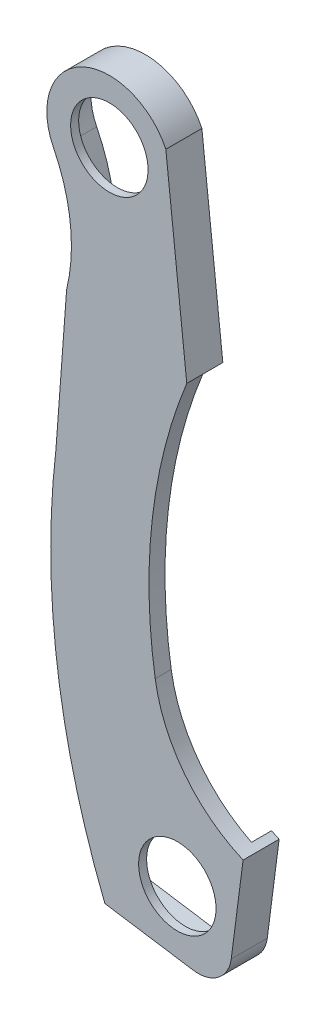
ISO-10303-21;
HEADER;
FILE_DESCRIPTION(('STEP AP214'),'2;1');
FILE_NAME('part.step','',(''),(''),'','','');
FILE_SCHEMA(('AUTOMOTIVE_DESIGN { 1 0 10303 214 1 1 1 1 }'));
ENDSEC;
DATA;
#1=APPLICATION_CONTEXT('core data for automotive mechanical design processes');
#2=APPLICATION_PROTOCOL_DEFINITION('international standard','automotive_design',2000,#1);
#3=PRODUCT_CONTEXT('',#1,'mechanical');
#4=PRODUCT('Part','Part','',(#3));
#5=PRODUCT_RELATED_PRODUCT_CATEGORY('part','',(#4));
#6=PRODUCT_DEFINITION_FORMATION('','',#4);
#7=PRODUCT_DEFINITION_CONTEXT('part definition',#1,'design');
#8=PRODUCT_DEFINITION('design','',#6,#7);
#9=PRODUCT_DEFINITION_SHAPE('','',#8);
#10=(LENGTH_UNIT() NAMED_UNIT(*) SI_UNIT(.MILLI.,.METRE.));
#11=(NAMED_UNIT(*) PLANE_ANGLE_UNIT() SI_UNIT($,.RADIAN.));
#12=(NAMED_UNIT(*) SI_UNIT($,.STERADIAN.) SOLID_ANGLE_UNIT());
#13=UNCERTAINTY_MEASURE_WITH_UNIT(LENGTH_MEASURE(1.E-05),#10,'distance_accuracy_value','');
#14=(GEOMETRIC_REPRESENTATION_CONTEXT(3) GLOBAL_UNCERTAINTY_ASSIGNED_CONTEXT((#13)) GLOBAL_UNIT_ASSIGNED_CONTEXT((#10,
#11,#12)) REPRESENTATION_CONTEXT('',''));
#15=CARTESIAN_POINT('',(0.,0.,0.));
#16=DIRECTION('',(0.,0.,1.));
#17=DIRECTION('',(1.,0.,0.));
#18=AXIS2_PLACEMENT_3D('',#15,#16,#17);
#19=CARTESIAN_POINT('',(57.3609756659918,78.037747086541,0.));
#20=DIRECTION('',(0.,0.,1.));
#21=DIRECTION('',(1.,0.,0.));
#22=AXIS2_PLACEMENT_3D('',#19,#20,#21);
#23=PLANE('',#22);
#24=DIRECTION('',(0.128345096378865,0.991729568095809,0.));
#25=VECTOR('',#24,1.);
#26=CARTESIAN_POINT('',(69.326238992548,25.8115460499817,0.));
#27=LINE('',#26,#25);
#28=CARTESIAN_POINT('',(68.1984366723897,17.0969559376612,0.));
#29=VERTEX_POINT('',#28);
#30=CARTESIAN_POINT('',(69.3570852276715,26.0498965931615,0.));
#31=VERTEX_POINT('',#30);
#32=EDGE_CURVE('E247',#29,#31,#27,.T.);
#33=ORIENTED_EDGE('',*,*,#32,.T.);
#34=CARTESIAN_POINT('',(75.6489756659918,38.667747086541,0.));
#35=DIRECTION('',(0.,0.,-1.));
#36=DIRECTION('',(1.,0.,0.));
#37=AXIS2_PLACEMENT_3D('',#34,#35,#36);
#38=CIRCLE('',#37,14.0995757511035);
#39=CARTESIAN_POINT('',(70.081936923437,25.713747086541,0.));
#40=VERTEX_POINT('',#39);
#41=EDGE_CURVE('E46',#40,#31,#38,.T.);
#42=ORIENTED_EDGE('',*,*,#41,.F.);
#43=DIRECTION('',(0.128345096378865,0.991729568095809,0.));
#44=VECTOR('',#43,1.);
#45=CARTESIAN_POINT('',(70.081936923437,25.713747086541,0.));
#46=LINE('',#45,#44);
#47=CARTESIAN_POINT('',(68.9541346032787,16.9991569742205,0.));
#48=VERTEX_POINT('',#47);
#49=EDGE_CURVE('E316',#48,#40,#46,.T.);
#50=ORIENTED_EDGE('',*,*,#49,.F.);
#51=CARTESIAN_POINT('',(65.8053932245745,17.4066526552234,0.));
#52=DIRECTION('',(0.,0.,1.));
#53=DIRECTION('',(1.,0.,0.));
#54=AXIS2_PLACEMENT_3D('',#51,#52,#53);
#55=CIRCLE('',#54,3.175);
#56=CARTESIAN_POINT('',(65.3242260184513,14.2683245780856,0.));
#57=VERTEX_POINT('',#56);
#58=EDGE_CURVE('E356',#48,#57,#55,.F.);
#59=ORIENTED_EDGE('',*,*,#58,.T.);
#60=DIRECTION('',(0.988449788074904,-0.151548726338026,0.));
#61=VECTOR('',#60,1.);
#62=CARTESIAN_POINT('',(56.9402848480354,15.553747086541,0.));
#63=LINE('',#62,#61);
#64=CARTESIAN_POINT('',(56.9402848480354,15.553747086541,0.));
#65=VERTEX_POINT('',#64);
#66=EDGE_CURVE('E312',#65,#57,#63,.T.);
#67=ORIENTED_EDGE('',*,*,#66,.F.);
#68=CARTESIAN_POINT('',(123.400975665992,42.223747086541,0.));
#69=DIRECTION('',(0.,0.,1.));
#70=DIRECTION('',(1.,0.,0.));
#71=AXIS2_PLACEMENT_3D('',#68,#69,#70);
#72=CIRCLE('',#71,71.6122358539377);
#73=CARTESIAN_POINT('',(52.2809756659918,50.605747086541,0.));
#74=VERTEX_POINT('',#73);
#75=EDGE_CURVE('E309',#74,#65,#72,.T.);
#76=ORIENTED_EDGE('',*,*,#75,.F.);
#77=DIRECTION('',(-0.0739753638047676,-0.997260069164484,0.));
#78=VECTOR('',#77,1.);
#79=CARTESIAN_POINT('',(53.2969756659918,64.3024182235043,0.));
#80=LINE('',#79,#78);
#81=CARTESIAN_POINT('',(53.2969756659918,64.3024182235043,0.));
#82=VERTEX_POINT('',#81);
#83=EDGE_CURVE('E306',#82,#74,#80,.T.);
#84=ORIENTED_EDGE('',*,*,#83,.F.);
#85=CARTESIAN_POINT('',(37.5489756659918,68.131747086541,0.));
#86=DIRECTION('',(0.,0.,-1.));
#87=DIRECTION('',(1.,0.,0.));
#88=AXIS2_PLACEMENT_3D('',#85,#86,#87);
#89=CIRCLE('',#88,16.2068893851129);
#90=CARTESIAN_POINT('',(52.0448582135648,75.3796883603275,0.));
#91=VERTEX_POINT('',#90);
#92=EDGE_CURVE('E302',#91,#82,#89,.T.);
#93=ORIENTED_EDGE('',*,*,#92,.F.);
#94=CARTESIAN_POINT('',(57.3609756659918,78.037747086541,0.));
#95=DIRECTION('',(0.,0.,1.));
#96=DIRECTION('',(1.,0.,0.));
#97=AXIS2_PLACEMENT_3D('',#94,#95,#96);
#98=CIRCLE('',#97,5.94359999999999);
#99=CARTESIAN_POINT('',(62.7345015996782,80.577747086541,0.));
#100=VERTEX_POINT('',#99);
#101=EDGE_CURVE('E298',#100,#91,#98,.T.);
#102=ORIENTED_EDGE('',*,*,#101,.F.);
#103=DIRECTION('',(-0.108308886592552,0.994117289400542,0.));
#104=VECTOR('',#103,1.);
#105=CARTESIAN_POINT('',(62.7345015996782,80.577747086541,0.));
#106=LINE('',#105,#104);
#107=CARTESIAN_POINT('',(64.7269756659918,62.289747086541,0.));
#108=VERTEX_POINT('',#107);
#109=EDGE_CURVE('E272',#108,#100,#106,.T.);
#110=ORIENTED_EDGE('',*,*,#109,.F.);
#111=DIRECTION('',(0.994117289400543,0.108308886592552,0.));
#112=VECTOR('',#111,1.);
#113=CARTESIAN_POINT('',(46.3979136865915,60.2927993255059,0.));
#114=LINE('',#113,#112);
#115=CARTESIAN_POINT('',(63.8672306434838,62.1960780324625,0.));
#116=VERTEX_POINT('',#115);
#117=EDGE_CURVE('E479',#116,#108,#114,.T.);
#118=ORIENTED_EDGE('',*,*,#117,.F.);
#119=CARTESIAN_POINT('',(109.430975665992,44.001747086541,0.));
#120=DIRECTION('',(0.,0.,1.));
#121=DIRECTION('',(1.,0.,0.));
#122=AXIS2_PLACEMENT_3D('',#119,#120,#121);
#123=CIRCLE('',#122,49.0620886127551);
#124=CARTESIAN_POINT('',(63.9486105484076,62.3985675280356,0.));
#125=VERTEX_POINT('',#124);
#126=EDGE_CURVE('E244',#116,#125,#123,.F.);
#127=ORIENTED_EDGE('',*,*,#126,.T.);
#128=DIRECTION('',(-0.108308886592552,0.994117289400542,0.));
#129=VECTOR('',#128,1.);
#130=CARTESIAN_POINT('',(61.976984225155,80.4952157149575,0.));
#131=LINE('',#130,#129);
#132=CARTESIAN_POINT('',(61.9913457586041,80.3633978267562,0.));
#133=VERTEX_POINT('',#132);
#134=EDGE_CURVE('E239',#125,#133,#131,.T.);
#135=ORIENTED_EDGE('',*,*,#134,.T.);
#136=CARTESIAN_POINT('',(57.3609756659918,78.037747086541,0.));
#137=DIRECTION('',(0.,0.,1.));
#138=DIRECTION('',(1.,0.,0.));
#139=AXIS2_PLACEMENT_3D('',#136,#137,#138);
#140=CIRCLE('',#139,5.1816);
#141=CARTESIAN_POINT('',(52.7264117331067,75.7204651200985,0.));
#142=VERTEX_POINT('',#141);
#143=EDGE_CURVE('E233',#133,#142,#140,.T.);
#144=ORIENTED_EDGE('',*,*,#143,.T.);
#145=CARTESIAN_POINT('',(37.5489756659918,68.131747086541,0.));
#146=DIRECTION('',(0.,0.,1.));
#147=DIRECTION('',(1.,0.,0.));
#148=AXIS2_PLACEMENT_3D('',#145,#146,#147);
#149=CIRCLE('',#148,16.9688893851129);
#150=CARTESIAN_POINT('',(54.052294981693,64.1841328034323,0.));
#151=VERTEX_POINT('',#150);
#152=EDGE_CURVE('E237',#142,#151,#149,.F.);
#153=ORIENTED_EDGE('',*,*,#152,.T.);
#154=DIRECTION('',(-0.0739753638047676,-0.997260069164485,0.));
#155=VECTOR('',#154,1.);
#156=CARTESIAN_POINT('',(54.0568878386952,64.2460489962851,0.));
#157=LINE('',#156,#155);
#158=CARTESIAN_POINT('',(53.039664752985,50.5328894707937,0.));
#159=VERTEX_POINT('',#158);
#160=EDGE_CURVE('E260',#151,#159,#157,.T.);
#161=ORIENTED_EDGE('',*,*,#160,.T.);
#162=CARTESIAN_POINT('',(123.400975665992,42.223747086541,0.));
#163=DIRECTION('',(0.,0.,1.));
#164=DIRECTION('',(1.,0.,0.));
#165=AXIS2_PLACEMENT_3D('',#162,#163,#164);
#166=CIRCLE('',#165,70.8502358539377);
#167=CARTESIAN_POINT('',(57.4870669911204,16.2408187727556,0.));
#168=VERTEX_POINT('',#167);
#169=EDGE_CURVE('E256',#159,#168,#166,.T.);
#170=ORIENTED_EDGE('',*,*,#169,.T.);
#171=DIRECTION('',(0.988449788074904,-0.151548726338026,0.));
#172=VECTOR('',#171,1.);
#173=CARTESIAN_POINT('',(57.055764977505,16.3069458250541,0.));
#174=LINE('',#173,#172);
#175=CARTESIAN_POINT('',(65.4397061479209,15.0215233165987,0.));
#176=VERTEX_POINT('',#175);
#177=EDGE_CURVE('E252',#168,#176,#174,.T.);
#178=ORIENTED_EDGE('',*,*,#177,.T.);
#179=CARTESIAN_POINT('',(65.8053932245745,17.4066526552234,0.));
#180=DIRECTION('',(0.,0.,1.));
#181=DIRECTION('',(1.,0.,0.));
#182=AXIS2_PLACEMENT_3D('',#179,#180,#181);
#183=CIRCLE('',#182,2.413);
#184=EDGE_CURVE('E248',#29,#176,#183,.F.);
#185=ORIENTED_EDGE('',*,*,#184,.F.);
#186=EDGE_LOOP('',(#33,#42,#50,#59,#67,#76,#84,#93,#102,#110,#118,#127,#135,#144,#153,#161,#170,
#178,#185));
#187=FACE_BOUND('',#186,.T.);
#188=ADVANCED_FACE('F42',(#187),#23,.F.);
#189=CARTESIAN_POINT('',(75.6489756659918,38.667747086541,3.429));
#190=DIRECTION('',(0.,0.,-1.));
#191=DIRECTION('',(-1.,0.,0.));
#192=AXIS2_PLACEMENT_3D('',#189,#190,#191);
#193=CYLINDRICAL_SURFACE('',#192,14.0995757511035);
#194=DIRECTION('',(0.,0.,-1.));
#195=VECTOR('',#194,1.);
#196=CARTESIAN_POINT('',(69.3570852276715,26.0498965931615,1.778));
#197=LINE('',#196,#195);
#198=CARTESIAN_POINT('',(69.3570852276715,26.0498965931615,1.905));
#199=VERTEX_POINT('',#198);
#200=EDGE_CURVE('E209',#199,#31,#197,.T.);
#201=ORIENTED_EDGE('',*,*,#200,.F.);
#202=CARTESIAN_POINT('',(75.6489756659918,38.667747086541,1.905));
#203=DIRECTION('',(0.,0.,1.));
#204=DIRECTION('',(0.,-1.,0.));
#205=AXIS2_PLACEMENT_3D('',#202,#203,#204);
#206=CIRCLE('',#205,14.0995757511035);
#207=CARTESIAN_POINT('',(61.7219369122,36.4687409675213,1.905));
#208=VERTEX_POINT('',#207);
#209=EDGE_CURVE('E199',#208,#199,#206,.T.);
#210=ORIENTED_EDGE('',*,*,#209,.F.);
#211=DIRECTION('',(0.,0.,-1.));
#212=VECTOR('',#211,1.);
#213=CARTESIAN_POINT('',(61.7219369122,36.4687409675213,3.429));
#214=LINE('',#213,#212);
#215=CARTESIAN_POINT('',(61.7219369122,36.4687409675213,3.429));
#216=VERTEX_POINT('',#215);
#217=EDGE_CURVE('E328',#216,#208,#214,.T.);
#218=ORIENTED_EDGE('',*,*,#217,.F.);
#219=CARTESIAN_POINT('',(75.6489756659918,38.667747086541,3.429));
#220=DIRECTION('',(0.,0.,-1.));
#221=DIRECTION('',(1.,0.,0.));
#222=AXIS2_PLACEMENT_3D('',#219,#220,#221);
#223=CIRCLE('',#222,14.0995757511035);
#224=CARTESIAN_POINT('',(70.081936923437,25.713747086541,3.429));
#225=VERTEX_POINT('',#224);
#226=EDGE_CURVE('E288',#225,#216,#223,.T.);
#227=ORIENTED_EDGE('',*,*,#226,.F.);
#228=DIRECTION('',(0.,0.,-1.));
#229=VECTOR('',#228,1.);
#230=CARTESIAN_POINT('',(70.081936923437,25.713747086541,3.429));
#231=LINE('',#230,#229);
#232=EDGE_CURVE('E332',#225,#40,#231,.T.);
#233=ORIENTED_EDGE('',*,*,#232,.T.);
#234=ORIENTED_EDGE('',*,*,#41,.T.);
#235=EDGE_LOOP('',(#201,#210,#218,#227,#233,#234));
#236=FACE_BOUND('',#235,.T.);
#237=ADVANCED_FACE('F373',(#236),#193,.F.);
#238=CARTESIAN_POINT('',(75.6489756659918,38.667747086541,3.429));
#239=DIRECTION('',(0.,0.,-1.));
#240=DIRECTION('',(-1.,0.,0.));
#241=AXIS2_PLACEMENT_3D('',#238,#239,#240);
#242=CYLINDRICAL_SURFACE('',#241,14.8615757511035);
#243=CARTESIAN_POINT('',(75.6489756659918,38.667747086541,1.905));
#244=DIRECTION('',(0.,0.,1.));
#245=DIRECTION('',(0.,-1.,0.));
#246=AXIS2_PLACEMENT_3D('',#243,#244,#245);
#247=CIRCLE('',#246,14.8615757511035);
#248=CARTESIAN_POINT('',(60.9692615326193,36.3498974865348,1.90499999999999));
#249=VERTEX_POINT('',#248);
#250=CARTESIAN_POINT('',(69.2538877410961,25.2524839792203,1.905));
#251=VERTEX_POINT('',#250);
#252=EDGE_CURVE('E61',#249,#251,#247,.T.);
#253=ORIENTED_EDGE('',*,*,#252,.T.);
#254=DIRECTION('',(0.,0.,-1.));
#255=VECTOR('',#254,1.);
#256=CARTESIAN_POINT('',(69.2538877410961,25.2524839792203,2.667));
#257=LINE('',#256,#255);
#258=CARTESIAN_POINT('',(69.2538877410961,25.2524839792203,2.667));
#259=VERTEX_POINT('',#258);
#260=EDGE_CURVE('E193',#259,#251,#257,.T.);
#261=ORIENTED_EDGE('',*,*,#260,.F.);
#262=CARTESIAN_POINT('',(75.6489756659918,38.667747086541,2.667));
#263=DIRECTION('',(0.,0.,1.));
#264=DIRECTION('',(1.,0.,0.));
#265=AXIS2_PLACEMENT_3D('',#262,#263,#264);
#266=CIRCLE('',#265,14.8615757511035);
#267=CARTESIAN_POINT('',(60.9692615326193,36.3498974865348,2.667));
#268=VERTEX_POINT('',#267);
#269=EDGE_CURVE('E537',#259,#268,#266,.F.);
#270=ORIENTED_EDGE('',*,*,#269,.T.);
#271=DIRECTION('',(0.,0.,-1.));
#272=VECTOR('',#271,1.);
#273=CARTESIAN_POINT('',(60.9692615326193,36.3498974865348,3.429));
#274=LINE('',#273,#272);
#275=EDGE_CURVE('E196',#268,#249,#274,.T.);
#276=ORIENTED_EDGE('',*,*,#275,.T.);
#277=EDGE_LOOP('',(#253,#261,#270,#276));
#278=FACE_BOUND('',#277,.T.);
#279=ADVANCED_FACE('F191',(#278),#242,.T.);
#280=CARTESIAN_POINT('',(57.3609756659918,78.037747086541,3.429));
#281=DIRECTION('',(0.,0.,-1.));
#282=DIRECTION('',(-1.,0.,0.));
#283=AXIS2_PLACEMENT_3D('',#280,#281,#282);
#284=CYLINDRICAL_SURFACE('',#283,5.94359999999999);
#285=ORIENTED_EDGE('',*,*,#101,.T.);
#286=DIRECTION('',(0.,0.,-1.));
#287=VECTOR('',#286,1.);
#288=CARTESIAN_POINT('',(52.0448582135648,75.3796883603275,3.429));
#289=LINE('',#288,#287);
#290=CARTESIAN_POINT('',(52.0448582135648,75.3796883603275,3.429));
#291=VERTEX_POINT('',#290);
#292=EDGE_CURVE('E348',#291,#91,#289,.T.);
#293=ORIENTED_EDGE('',*,*,#292,.F.);
#294=CARTESIAN_POINT('',(57.3609756659918,78.037747086541,3.429));
#295=DIRECTION('',(0.,0.,1.));
#296=DIRECTION('',(1.,0.,0.));
#297=AXIS2_PLACEMENT_3D('',#294,#295,#296);
#298=CIRCLE('',#297,5.94359999999999);
#299=CARTESIAN_POINT('',(62.7345015996782,80.577747086541,3.429));
#300=VERTEX_POINT('',#299);
#301=EDGE_CURVE('E267',#300,#291,#298,.T.);
#302=ORIENTED_EDGE('',*,*,#301,.F.);
#303=DIRECTION('',(0.,0.,-1.));
#304=VECTOR('',#303,1.);
#305=CARTESIAN_POINT('',(62.7345015996782,80.577747086541,3.429));
#306=LINE('',#305,#304);
#307=EDGE_CURVE('E297',#300,#100,#306,.T.);
#308=ORIENTED_EDGE('',*,*,#307,.T.);
#309=EDGE_LOOP('',(#285,#293,#302,#308));
#310=FACE_BOUND('',#309,.T.);
#311=ADVANCED_FACE('F628',(#310),#284,.T.);
#312=CARTESIAN_POINT('',(37.5489756659918,68.131747086541,3.429));
#313=DIRECTION('',(0.,0.,-1.));
#314=DIRECTION('',(-1.,0.,0.));
#315=AXIS2_PLACEMENT_3D('',#312,#313,#314);
#316=CYLINDRICAL_SURFACE('',#315,16.2068893851129);
#317=ORIENTED_EDGE('',*,*,#92,.T.);
#318=DIRECTION('',(0.,0.,-1.));
#319=VECTOR('',#318,1.);
#320=CARTESIAN_POINT('',(53.2969756659918,64.3024182235043,3.429));
#321=LINE('',#320,#319);
#322=CARTESIAN_POINT('',(53.2969756659918,64.3024182235043,3.429));
#323=VERTEX_POINT('',#322);
#324=EDGE_CURVE('E344',#323,#82,#321,.T.);
#325=ORIENTED_EDGE('',*,*,#324,.F.);
#326=CARTESIAN_POINT('',(37.5489756659918,68.131747086541,3.429));
#327=DIRECTION('',(0.,0.,-1.));
#328=DIRECTION('',(1.,0.,0.));
#329=AXIS2_PLACEMENT_3D('',#326,#327,#328);
#330=CIRCLE('',#329,16.2068893851129);
#331=EDGE_CURVE('E271',#291,#323,#330,.T.);
#332=ORIENTED_EDGE('',*,*,#331,.F.);
#333=ORIENTED_EDGE('',*,*,#292,.T.);
#334=EDGE_LOOP('',(#317,#325,#332,#333));
#335=FACE_BOUND('',#334,.T.);
#336=ADVANCED_FACE('F625',(#335),#316,.F.);
#337=CARTESIAN_POINT('',(53.2969756659918,64.3024182235043,3.429));
#338=DIRECTION('',(0.997260069164485,-0.0739753638047676,0.));
#339=DIRECTION('',(0.0739753638047676,0.997260069164485,0.));
#340=AXIS2_PLACEMENT_3D('',#337,#338,#339);
#341=PLANE('',#340);
#342=ORIENTED_EDGE('',*,*,#83,.T.);
#343=DIRECTION('',(0.,0.,-1.));
#344=VECTOR('',#343,1.);
#345=CARTESIAN_POINT('',(52.2809756659918,50.605747086541,3.429));
#346=LINE('',#345,#344);
#347=CARTESIAN_POINT('',(52.2809756659918,50.605747086541,3.429));
#348=VERTEX_POINT('',#347);
#349=EDGE_CURVE('E340',#348,#74,#346,.T.);
#350=ORIENTED_EDGE('',*,*,#349,.F.);
#351=DIRECTION('',(-0.0739753638047676,-0.997260069164484,0.));
#352=VECTOR('',#351,1.);
#353=CARTESIAN_POINT('',(53.2969756659918,64.3024182235043,3.429));
#354=LINE('',#353,#352);
#355=EDGE_CURVE('E275',#323,#348,#354,.T.);
#356=ORIENTED_EDGE('',*,*,#355,.F.);
#357=ORIENTED_EDGE('',*,*,#324,.T.);
#358=EDGE_LOOP('',(#342,#350,#356,#357));
#359=FACE_BOUND('',#358,.T.);
#360=ADVANCED_FACE('F621',(#359),#341,.F.);
#361=CARTESIAN_POINT('',(123.400975665992,42.223747086541,3.429));
#362=DIRECTION('',(0.,0.,-1.));
#363=DIRECTION('',(-1.,0.,0.));
#364=AXIS2_PLACEMENT_3D('',#361,#362,#363);
#365=CYLINDRICAL_SURFACE('',#364,71.6122358539377);
#366=ORIENTED_EDGE('',*,*,#75,.T.);
#367=DIRECTION('',(0.,0.,-1.));
#368=VECTOR('',#367,1.);
#369=CARTESIAN_POINT('',(56.9402848480354,15.553747086541,3.429));
#370=LINE('',#369,#368);
#371=CARTESIAN_POINT('',(56.9402848480354,15.553747086541,3.429));
#372=VERTEX_POINT('',#371);
#373=EDGE_CURVE('E336',#372,#65,#370,.T.);
#374=ORIENTED_EDGE('',*,*,#373,.F.);
#375=CARTESIAN_POINT('',(123.400975665992,42.223747086541,3.429));
#376=DIRECTION('',(0.,0.,1.));
#377=DIRECTION('',(1.,0.,0.));
#378=AXIS2_PLACEMENT_3D('',#375,#376,#377);
#379=CIRCLE('',#378,71.6122358539377);
#380=EDGE_CURVE('E278',#348,#372,#379,.T.);
#381=ORIENTED_EDGE('',*,*,#380,.F.);
#382=ORIENTED_EDGE('',*,*,#349,.T.);
#383=EDGE_LOOP('',(#366,#374,#381,#382));
#384=FACE_BOUND('',#383,.T.);
#385=ADVANCED_FACE('F617',(#384),#365,.T.);
#386=CARTESIAN_POINT('',(56.9402848480354,15.553747086541,3.429));
#387=DIRECTION('',(0.151548726338026,0.988449788074904,0.));
#388=DIRECTION('',(-0.988449788074904,0.151548726338026,0.));
#389=AXIS2_PLACEMENT_3D('',#386,#387,#388);
#390=PLANE('',#389);
#391=ORIENTED_EDGE('',*,*,#66,.T.);
#392=DIRECTION('',(0.,0.,-1.));
#393=VECTOR('',#392,1.);
#394=CARTESIAN_POINT('',(65.3242260184513,14.2683245780856,3.429));
#395=LINE('',#394,#393);
#396=CARTESIAN_POINT('',(65.3242260184513,14.2683245780856,3.429));
#397=VERTEX_POINT('',#396);
#398=EDGE_CURVE('E53',#57,#397,#395,.F.);
#399=ORIENTED_EDGE('',*,*,#398,.T.);
#400=DIRECTION('',(0.988449788074904,-0.151548726338026,0.));
#401=VECTOR('',#400,1.);
#402=CARTESIAN_POINT('',(56.9402848480354,15.553747086541,3.429));
#403=LINE('',#402,#401);
#404=EDGE_CURVE('E281',#372,#397,#403,.T.);
#405=ORIENTED_EDGE('',*,*,#404,.F.);
#406=ORIENTED_EDGE('',*,*,#373,.T.);
#407=EDGE_LOOP('',(#391,#399,#405,#406));
#408=FACE_BOUND('',#407,.T.);
#409=ADVANCED_FACE('F613',(#408),#390,.F.);
#410=CARTESIAN_POINT('',(70.081936923437,25.713747086541,3.429));
#411=DIRECTION('',(-0.991729568095809,0.128345096378865,0.));
#412=DIRECTION('',(-0.128345096378865,-0.991729568095809,0.));
#413=AXIS2_PLACEMENT_3D('',#410,#411,#412);
#414=PLANE('',#413);
#415=DIRECTION('',(0.128345096378865,0.991729568095809,0.));
#416=VECTOR('',#415,1.);
#417=CARTESIAN_POINT('',(70.081936923437,25.713747086541,3.429));
#418=LINE('',#417,#416);
#419=CARTESIAN_POINT('',(68.9541346032787,16.9991569742205,3.429));
#420=VERTEX_POINT('',#419);
#421=EDGE_CURVE('E285',#420,#225,#418,.T.);
#422=ORIENTED_EDGE('',*,*,#421,.F.);
#423=DIRECTION('',(0.,0.,-1.));
#424=VECTOR('',#423,1.);
#425=CARTESIAN_POINT('',(68.9541346032787,16.9991569742205,3.429));
#426=LINE('',#425,#424);
#427=EDGE_CURVE('E352',#420,#48,#426,.T.);
#428=ORIENTED_EDGE('',*,*,#427,.T.);
#429=ORIENTED_EDGE('',*,*,#49,.T.);
#430=ORIENTED_EDGE('',*,*,#232,.F.);
#431=EDGE_LOOP('',(#422,#428,#429,#430));
#432=FACE_BOUND('',#431,.T.);
#433=ADVANCED_FACE('F608',(#432),#414,.F.);
#434=CARTESIAN_POINT('',(109.430975665992,44.001747086541,3.429));
#435=DIRECTION('',(0.,0.,-1.));
#436=DIRECTION('',(-1.,0.,0.));
#437=AXIS2_PLACEMENT_3D('',#434,#435,#436);
#438=CYLINDRICAL_SURFACE('',#437,48.3000886127551);
#439=ORIENTED_EDGE('',*,*,#217,.T.);
#440=CARTESIAN_POINT('',(109.430975665992,44.001747086541,1.905));
#441=DIRECTION('',(0.,0.,1.));
#442=DIRECTION('',(0.,-1.,0.));
#443=AXIS2_PLACEMENT_3D('',#440,#441,#442);
#444=CIRCLE('',#443,48.3000886127551);
#445=CARTESIAN_POINT('',(64.7269756659918,62.289747086541,1.905));
#446=VERTEX_POINT('',#445);
#447=EDGE_CURVE('E371',#446,#208,#444,.T.);
#448=ORIENTED_EDGE('',*,*,#447,.F.);
#449=DIRECTION('',(0.,0.,-1.));
#450=VECTOR('',#449,1.);
#451=CARTESIAN_POINT('',(64.7269756659918,62.289747086541,3.429));
#452=LINE('',#451,#450);
#453=CARTESIAN_POINT('',(64.7269756659918,62.289747086541,3.429));
#454=VERTEX_POINT('',#453);
#455=EDGE_CURVE('E324',#454,#446,#452,.T.);
#456=ORIENTED_EDGE('',*,*,#455,.F.);
#457=CARTESIAN_POINT('',(109.430975665992,44.001747086541,3.429));
#458=DIRECTION('',(0.,0.,-1.));
#459=DIRECTION('',(1.,0.,0.));
#460=AXIS2_PLACEMENT_3D('',#457,#458,#459);
#461=CIRCLE('',#460,48.3000886127551);
#462=EDGE_CURVE('E291',#216,#454,#461,.T.);
#463=ORIENTED_EDGE('',*,*,#462,.F.);
#464=EDGE_LOOP('',(#439,#448,#456,#463));
#465=FACE_BOUND('',#464,.T.);
#466=ADVANCED_FACE('F605',(#465),#438,.F.);
#467=CARTESIAN_POINT('',(62.7345015996782,80.577747086541,3.429));
#468=DIRECTION('',(-0.994117289400542,-0.108308886592552,0.));
#469=DIRECTION('',(0.108308886592552,-0.994117289400542,0.));
#470=AXIS2_PLACEMENT_3D('',#467,#468,#469);
#471=PLANE('',#470);
#472=ORIENTED_EDGE('',*,*,#109,.T.);
#473=ORIENTED_EDGE('',*,*,#307,.F.);
#474=DIRECTION('',(-0.108308886592552,0.994117289400542,0.));
#475=VECTOR('',#474,1.);
#476=CARTESIAN_POINT('',(62.7345015996782,80.577747086541,3.429));
#477=LINE('',#476,#475);
#478=EDGE_CURVE('E294',#454,#300,#477,.T.);
#479=ORIENTED_EDGE('',*,*,#478,.F.);
#480=ORIENTED_EDGE('',*,*,#455,.T.);
#481=DIRECTION('',(0.,0.,1.));
#482=VECTOR('',#481,1.);
#483=CARTESIAN_POINT('',(64.7269756659918,62.289747086541,1.905));
#484=LINE('',#483,#482);
#485=EDGE_CURVE('E484',#108,#446,#484,.T.);
#486=ORIENTED_EDGE('',*,*,#485,.F.);
#487=EDGE_LOOP('',(#472,#473,#479,#480,#486));
#488=FACE_BOUND('',#487,.T.);
#489=ADVANCED_FACE('F602',(#488),#471,.F.);
#490=CARTESIAN_POINT('',(57.3609756659918,78.037747086541,3.429));
#491=DIRECTION('',(0.,0.,1.));
#492=DIRECTION('',(1.,0.,0.));
#493=AXIS2_PLACEMENT_3D('',#490,#491,#492);
#494=PLANE('',#493);
#495=CARTESIAN_POINT('',(57.3609756659918,78.037747086541,3.429));
#496=DIRECTION('',(0.,0.,1.));
#497=DIRECTION('',(1.,0.,0.));
#498=AXIS2_PLACEMENT_3D('',#495,#496,#497);
#499=CIRCLE('',#498,3.683);
#500=CARTESIAN_POINT('',(53.6779756659918,78.037747086541,3.429));
#501=VERTEX_POINT('',#500);
#502=EDGE_CURVE('E461',#501,#501,#499,.F.);
#503=ORIENTED_EDGE('',*,*,#502,.T.);
#504=EDGE_LOOP('',(#503));
#505=FACE_BOUND('',#504,.T.);
#506=CARTESIAN_POINT('',(63.8264134086376,20.4210818214808,3.429));
#507=DIRECTION('',(0.,0.,1.));
#508=DIRECTION('',(1.,0.,0.));
#509=AXIS2_PLACEMENT_3D('',#506,#507,#508);
#510=CIRCLE('',#509,3.68299999999999);
#511=CARTESIAN_POINT('',(60.1434134086376,20.4210818214808,3.429));
#512=VERTEX_POINT('',#511);
#513=EDGE_CURVE('E467',#512,#512,#510,.F.);
#514=ORIENTED_EDGE('',*,*,#513,.T.);
#515=EDGE_LOOP('',(#514));
#516=FACE_BOUND('',#515,.T.);
#517=ORIENTED_EDGE('',*,*,#404,.T.);
#518=CARTESIAN_POINT('',(65.8053932245745,17.4066526552234,3.429));
#519=DIRECTION('',(0.,0.,1.));
#520=DIRECTION('',(1.,0.,0.));
#521=AXIS2_PLACEMENT_3D('',#518,#519,#520);
#522=CIRCLE('',#521,3.175);
#523=EDGE_CURVE('E11',#397,#420,#522,.T.);
#524=ORIENTED_EDGE('',*,*,#523,.T.);
#525=ORIENTED_EDGE('',*,*,#421,.T.);
#526=ORIENTED_EDGE('',*,*,#226,.T.);
#527=ORIENTED_EDGE('',*,*,#462,.T.);
#528=ORIENTED_EDGE('',*,*,#478,.T.);
#529=ORIENTED_EDGE('',*,*,#301,.T.);
#530=ORIENTED_EDGE('',*,*,#331,.T.);
#531=ORIENTED_EDGE('',*,*,#355,.T.);
#532=ORIENTED_EDGE('',*,*,#380,.T.);
#533=EDGE_LOOP('',(#517,#524,#525,#526,#527,#528,#529,#530,#531,#532));
#534=FACE_BOUND('',#533,.T.);
#535=ADVANCED_FACE('F600',(#505,#516,#534),#494,.T.);
#536=CARTESIAN_POINT('',(65.8053932245745,17.4066526552234,3.429));
#537=DIRECTION('',(0.,0.,-1.));
#538=DIRECTION('',(-1.,0.,0.));
#539=AXIS2_PLACEMENT_3D('',#536,#537,#538);
#540=CYLINDRICAL_SURFACE('',#539,3.175);
#541=ORIENTED_EDGE('',*,*,#523,.F.);
#542=ORIENTED_EDGE('',*,*,#398,.F.);
#543=ORIENTED_EDGE('',*,*,#58,.F.);
#544=ORIENTED_EDGE('',*,*,#427,.F.);
#545=EDGE_LOOP('',(#541,#542,#543,#544));
#546=FACE_BOUND('',#545,.T.);
#547=ADVANCED_FACE('F44',(#546),#540,.T.);
#548=CARTESIAN_POINT('',(57.3609756659918,78.037747086541,3.429));
#549=DIRECTION('',(0.,0.,-1.));
#550=DIRECTION('',(-1.,0.,0.));
#551=AXIS2_PLACEMENT_3D('',#548,#549,#550);
#552=CYLINDRICAL_SURFACE('',#551,5.1816);
#553=ORIENTED_EDGE('',*,*,#143,.F.);
#554=DIRECTION('',(0.,0.,-1.));
#555=VECTOR('',#554,1.);
#556=CARTESIAN_POINT('',(61.9913457586041,80.3633978267562,2.667));
#557=LINE('',#556,#555);
#558=CARTESIAN_POINT('',(61.9913457586041,80.3633978267562,2.667));
#559=VERTEX_POINT('',#558);
#560=EDGE_CURVE('E232',#559,#133,#557,.T.);
#561=ORIENTED_EDGE('',*,*,#560,.F.);
#562=CARTESIAN_POINT('',(57.3609756659918,78.037747086541,2.667));
#563=DIRECTION('',(0.,0.,1.));
#564=DIRECTION('',(1.,0.,0.));
#565=AXIS2_PLACEMENT_3D('',#562,#563,#564);
#566=CIRCLE('',#565,5.1816);
#567=CARTESIAN_POINT('',(52.7264117331067,75.7204651200985,2.667));
#568=VERTEX_POINT('',#567);
#569=EDGE_CURVE('E243',#559,#568,#566,.T.);
#570=ORIENTED_EDGE('',*,*,#569,.T.);
#571=DIRECTION('',(0.,0.,-1.));
#572=VECTOR('',#571,1.);
#573=CARTESIAN_POINT('',(52.7264117331067,75.7204651200985,3.429));
#574=LINE('',#573,#572);
#575=EDGE_CURVE('E424',#568,#142,#574,.T.);
#576=ORIENTED_EDGE('',*,*,#575,.T.);
#577=EDGE_LOOP('',(#553,#561,#570,#576));
#578=FACE_BOUND('',#577,.T.);
#579=ADVANCED_FACE('F555',(#578),#552,.F.);
#580=CARTESIAN_POINT('',(37.5489756659918,68.131747086541,3.429));
#581=DIRECTION('',(0.,0.,-1.));
#582=DIRECTION('',(-1.,0.,0.));
#583=AXIS2_PLACEMENT_3D('',#580,#581,#582);
#584=CYLINDRICAL_SURFACE('',#583,16.9688893851129);
#585=ORIENTED_EDGE('',*,*,#152,.F.);
#586=ORIENTED_EDGE('',*,*,#575,.F.);
#587=CARTESIAN_POINT('',(37.5489756659918,68.131747086541,2.667));
#588=DIRECTION('',(0.,0.,1.));
#589=DIRECTION('',(1.,0.,0.));
#590=AXIS2_PLACEMENT_3D('',#587,#588,#589);
#591=CIRCLE('',#590,16.9688893851129);
#592=CARTESIAN_POINT('',(54.052294981693,64.1841328034323,2.667));
#593=VERTEX_POINT('',#592);
#594=EDGE_CURVE('E519',#568,#593,#591,.F.);
#595=ORIENTED_EDGE('',*,*,#594,.T.);
#596=DIRECTION('',(0.,0.,-1.));
#597=VECTOR('',#596,1.);
#598=CARTESIAN_POINT('',(54.052294981693,64.1841328034323,2.667));
#599=LINE('',#598,#597);
#600=EDGE_CURVE('E429',#593,#151,#599,.T.);
#601=ORIENTED_EDGE('',*,*,#600,.T.);
#602=EDGE_LOOP('',(#585,#586,#595,#601));
#603=FACE_BOUND('',#602,.T.);
#604=ADVANCED_FACE('F563',(#603),#584,.T.);
#605=CARTESIAN_POINT('',(54.0568878386952,64.2460489962851,3.429));
#606=DIRECTION('',(0.997260069164485,-0.0739753638047676,0.));
#607=DIRECTION('',(0.0739753638047676,0.997260069164485,0.));
#608=AXIS2_PLACEMENT_3D('',#605,#606,#607);
#609=PLANE('',#608);
#610=ORIENTED_EDGE('',*,*,#160,.F.);
#611=ORIENTED_EDGE('',*,*,#600,.F.);
#612=DIRECTION('',(-0.0739753638047676,-0.997260069164485,0.));
#613=VECTOR('',#612,1.);
#614=CARTESIAN_POINT('',(54.0568878386952,64.2460489962851,2.667));
#615=LINE('',#614,#613);
#616=CARTESIAN_POINT('',(53.039664752985,50.5328894707937,2.667));
#617=VERTEX_POINT('',#616);
#618=EDGE_CURVE('E524',#593,#617,#615,.T.);
#619=ORIENTED_EDGE('',*,*,#618,.T.);
#620=DIRECTION('',(0.,0.,-1.));
#621=VECTOR('',#620,1.);
#622=CARTESIAN_POINT('',(53.039664752985,50.5328894707937,2.667));
#623=LINE('',#622,#621);
#624=EDGE_CURVE('E221',#617,#159,#623,.T.);
#625=ORIENTED_EDGE('',*,*,#624,.T.);
#626=EDGE_LOOP('',(#610,#611,#619,#625));
#627=FACE_BOUND('',#626,.T.);
#628=ADVANCED_FACE('F566',(#627),#609,.T.);
#629=CARTESIAN_POINT('',(123.400975665992,42.223747086541,3.429));
#630=DIRECTION('',(0.,0.,-1.));
#631=DIRECTION('',(-1.,0.,0.));
#632=AXIS2_PLACEMENT_3D('',#629,#630,#631);
#633=CYLINDRICAL_SURFACE('',#632,70.8502358539377);
#634=ORIENTED_EDGE('',*,*,#169,.F.);
#635=ORIENTED_EDGE('',*,*,#624,.F.);
#636=CARTESIAN_POINT('',(123.400975665992,42.223747086541,2.667));
#637=DIRECTION('',(0.,0.,1.));
#638=DIRECTION('',(1.,0.,0.));
#639=AXIS2_PLACEMENT_3D('',#636,#637,#638);
#640=CIRCLE('',#639,70.8502358539377);
#641=CARTESIAN_POINT('',(57.4870669911204,16.2408187727556,2.667));
#642=VERTEX_POINT('',#641);
#643=EDGE_CURVE('E527',#617,#642,#640,.T.);
#644=ORIENTED_EDGE('',*,*,#643,.T.);
#645=DIRECTION('',(0.,0.,-1.));
#646=VECTOR('',#645,1.);
#647=CARTESIAN_POINT('',(57.4870669911204,16.2408187727556,2.667));
#648=LINE('',#647,#646);
#649=EDGE_CURVE('E216',#642,#168,#648,.T.);
#650=ORIENTED_EDGE('',*,*,#649,.T.);
#651=EDGE_LOOP('',(#634,#635,#644,#650));
#652=FACE_BOUND('',#651,.T.);
#653=ADVANCED_FACE('F583',(#652),#633,.F.);
#654=CARTESIAN_POINT('',(57.055764977505,16.3069458250541,3.429));
#655=DIRECTION('',(0.151548726338026,0.988449788074904,0.));
#656=DIRECTION('',(-0.988449788074904,0.151548726338026,0.));
#657=AXIS2_PLACEMENT_3D('',#654,#655,#656);
#658=PLANE('',#657);
#659=ORIENTED_EDGE('',*,*,#177,.F.);
#660=ORIENTED_EDGE('',*,*,#649,.F.);
#661=DIRECTION('',(0.988449788074904,-0.151548726338026,0.));
#662=VECTOR('',#661,1.);
#663=CARTESIAN_POINT('',(57.055764977505,16.3069458250541,2.667));
#664=LINE('',#663,#662);
#665=CARTESIAN_POINT('',(65.4397061479209,15.0215233165987,2.667));
#666=VERTEX_POINT('',#665);
#667=EDGE_CURVE('E530',#642,#666,#664,.T.);
#668=ORIENTED_EDGE('',*,*,#667,.T.);
#669=DIRECTION('',(0.,0.,1.));
#670=VECTOR('',#669,1.);
#671=CARTESIAN_POINT('',(65.4397061479209,15.0215233165987,3.429));
#672=LINE('',#671,#670);
#673=EDGE_CURVE('E251',#176,#666,#672,.T.);
#674=ORIENTED_EDGE('',*,*,#673,.F.);
#675=EDGE_LOOP('',(#659,#660,#668,#674));
#676=FACE_BOUND('',#675,.T.);
#677=ADVANCED_FACE('F581',(#676),#658,.T.);
#678=CARTESIAN_POINT('',(69.326238992548,25.8115460499817,3.429));
#679=DIRECTION('',(-0.991729568095809,0.128345096378865,0.));
#680=DIRECTION('',(-0.128345096378865,-0.991729568095809,0.));
#681=AXIS2_PLACEMENT_3D('',#678,#679,#680);
#682=PLANE('',#681);
#683=DIRECTION('',(0.128345096378865,0.991729568095809,0.));
#684=VECTOR('',#683,1.);
#685=CARTESIAN_POINT('',(69.326238992548,25.8115460499817,2.667));
#686=LINE('',#685,#684);
#687=CARTESIAN_POINT('',(68.1984366723897,17.0969559376612,2.667));
#688=VERTEX_POINT('',#687);
#689=EDGE_CURVE('E214',#688,#259,#686,.T.);
#690=ORIENTED_EDGE('',*,*,#689,.T.);
#691=ORIENTED_EDGE('',*,*,#260,.T.);
#692=DIRECTION('',(-0.128345096378845,-0.991729568095812,0.));
#693=VECTOR('',#692,1.);
#694=CARTESIAN_POINT('',(69.3570852276715,26.0498965931615,1.905));
#695=LINE('',#694,#693);
#696=EDGE_CURVE('E202',#199,#251,#695,.T.);
#697=ORIENTED_EDGE('',*,*,#696,.F.);
#698=ORIENTED_EDGE('',*,*,#200,.T.);
#699=ORIENTED_EDGE('',*,*,#32,.F.);
#700=DIRECTION('',(0.,0.,1.));
#701=VECTOR('',#700,1.);
#702=CARTESIAN_POINT('',(68.1984366723897,17.0969559376612,3.429));
#703=LINE('',#702,#701);
#704=EDGE_CURVE('E226',#688,#29,#703,.F.);
#705=ORIENTED_EDGE('',*,*,#704,.F.);
#706=EDGE_LOOP('',(#690,#691,#697,#698,#699,#705));
#707=FACE_BOUND('',#706,.T.);
#708=ADVANCED_FACE('F211',(#707),#682,.T.);
#709=CARTESIAN_POINT('',(109.430975665992,44.001747086541,3.429));
#710=DIRECTION('',(0.,0.,-1.));
#711=DIRECTION('',(-1.,0.,0.));
#712=AXIS2_PLACEMENT_3D('',#709,#710,#711);
#713=CYLINDRICAL_SURFACE('',#712,49.0620886127551);
#714=DIRECTION('',(0.,0.,-1.));
#715=VECTOR('',#714,1.);
#716=CARTESIAN_POINT('',(63.8672306434838,62.1960780324624,3.429));
#717=LINE('',#716,#715);
#718=CARTESIAN_POINT('',(63.8672306434838,62.1960780324624,1.905));
#719=VERTEX_POINT('',#718);
#720=EDGE_CURVE('E198',#116,#719,#717,.F.);
#721=ORIENTED_EDGE('',*,*,#720,.T.);
#722=CARTESIAN_POINT('',(109.430975665992,44.001747086541,1.905));
#723=DIRECTION('',(0.,0.,1.));
#724=DIRECTION('',(0.,-1.,0.));
#725=AXIS2_PLACEMENT_3D('',#722,#723,#724);
#726=CIRCLE('',#725,49.0620886127551);
#727=EDGE_CURVE('E490',#719,#249,#726,.T.);
#728=ORIENTED_EDGE('',*,*,#727,.T.);
#729=ORIENTED_EDGE('',*,*,#275,.F.);
#730=CARTESIAN_POINT('',(109.430975665992,44.001747086541,2.667));
#731=DIRECTION('',(0.,0.,1.));
#732=DIRECTION('',(1.,0.,0.));
#733=AXIS2_PLACEMENT_3D('',#730,#731,#732);
#734=CIRCLE('',#733,49.0620886127551);
#735=CARTESIAN_POINT('',(63.9486105484076,62.3985675280356,2.667));
#736=VERTEX_POINT('',#735);
#737=EDGE_CURVE('E540',#268,#736,#734,.F.);
#738=ORIENTED_EDGE('',*,*,#737,.T.);
#739=DIRECTION('',(0.,0.,-1.));
#740=VECTOR('',#739,1.);
#741=CARTESIAN_POINT('',(63.9486105484076,62.3985675280356,2.667));
#742=LINE('',#741,#740);
#743=EDGE_CURVE('E223',#736,#125,#742,.T.);
#744=ORIENTED_EDGE('',*,*,#743,.T.);
#745=ORIENTED_EDGE('',*,*,#126,.F.);
#746=EDGE_LOOP('',(#721,#728,#729,#738,#744,#745));
#747=FACE_BOUND('',#746,.T.);
#748=ADVANCED_FACE('F573',(#747),#713,.T.);
#749=CARTESIAN_POINT('',(61.976984225155,80.4952157149575,3.429));
#750=DIRECTION('',(-0.994117289400542,-0.108308886592552,0.));
#751=DIRECTION('',(0.108308886592552,-0.994117289400542,0.));
#752=AXIS2_PLACEMENT_3D('',#749,#750,#751);
#753=PLANE('',#752);
#754=ORIENTED_EDGE('',*,*,#134,.F.);
#755=ORIENTED_EDGE('',*,*,#743,.F.);
#756=DIRECTION('',(-0.108308886592552,0.994117289400542,0.));
#757=VECTOR('',#756,1.);
#758=CARTESIAN_POINT('',(61.976984225155,80.4952157149575,2.667));
#759=LINE('',#758,#757);
#760=EDGE_CURVE('E521',#736,#559,#759,.T.);
#761=ORIENTED_EDGE('',*,*,#760,.T.);
#762=ORIENTED_EDGE('',*,*,#560,.T.);
#763=EDGE_LOOP('',(#754,#755,#761,#762));
#764=FACE_BOUND('',#763,.T.);
#765=ADVANCED_FACE('F549',(#764),#753,.T.);
#766=CARTESIAN_POINT('',(57.3609756659918,78.037747086541,2.667));
#767=DIRECTION('',(0.,0.,1.));
#768=DIRECTION('',(1.,0.,0.));
#769=AXIS2_PLACEMENT_3D('',#766,#767,#768);
#770=PLANE('',#769);
#771=CARTESIAN_POINT('',(57.3609756659918,78.037747086541,2.667));
#772=DIRECTION('',(0.,0.,1.));
#773=DIRECTION('',(1.,0.,0.));
#774=AXIS2_PLACEMENT_3D('',#771,#772,#773);
#775=CIRCLE('',#774,3.683);
#776=CARTESIAN_POINT('',(53.6779756659918,78.037747086541,2.667));
#777=VERTEX_POINT('',#776);
#778=EDGE_CURVE('E238',#777,#777,#775,.T.);
#779=ORIENTED_EDGE('',*,*,#778,.T.);
#780=EDGE_LOOP('',(#779));
#781=FACE_BOUND('',#780,.T.);
#782=CARTESIAN_POINT('',(63.8264134086376,20.4210818214808,2.667));
#783=DIRECTION('',(0.,0.,1.));
#784=DIRECTION('',(1.,0.,0.));
#785=AXIS2_PLACEMENT_3D('',#782,#783,#784);
#786=CIRCLE('',#785,3.68299999999999);
#787=CARTESIAN_POINT('',(60.1434134086376,20.4210818214808,2.667));
#788=VERTEX_POINT('',#787);
#789=EDGE_CURVE('E455',#788,#788,#786,.T.);
#790=ORIENTED_EDGE('',*,*,#789,.T.);
#791=EDGE_LOOP('',(#790));
#792=FACE_BOUND('',#791,.T.);
#793=ORIENTED_EDGE('',*,*,#667,.F.);
#794=ORIENTED_EDGE('',*,*,#643,.F.);
#795=ORIENTED_EDGE('',*,*,#618,.F.);
#796=ORIENTED_EDGE('',*,*,#594,.F.);
#797=ORIENTED_EDGE('',*,*,#569,.F.);
#798=ORIENTED_EDGE('',*,*,#760,.F.);
#799=ORIENTED_EDGE('',*,*,#737,.F.);
#800=ORIENTED_EDGE('',*,*,#269,.F.);
#801=ORIENTED_EDGE('',*,*,#689,.F.);
#802=CARTESIAN_POINT('',(65.8053932245745,17.4066526552234,2.667));
#803=DIRECTION('',(0.,0.,1.));
#804=DIRECTION('',(1.,0.,0.));
#805=AXIS2_PLACEMENT_3D('',#802,#803,#804);
#806=CIRCLE('',#805,2.413);
#807=EDGE_CURVE('E303',#666,#688,#806,.T.);
#808=ORIENTED_EDGE('',*,*,#807,.F.);
#809=EDGE_LOOP('',(#793,#794,#795,#796,#797,#798,#799,#800,#801,#808));
#810=FACE_BOUND('',#809,.T.);
#811=ADVANCED_FACE('F558',(#781,#792,#810),#770,.F.);
#812=CARTESIAN_POINT('',(65.8053932245745,17.4066526552234,3.429));
#813=DIRECTION('',(0.,0.,-1.));
#814=DIRECTION('',(-1.,0.,0.));
#815=AXIS2_PLACEMENT_3D('',#812,#813,#814);
#816=CYLINDRICAL_SURFACE('',#815,2.413);
#817=ORIENTED_EDGE('',*,*,#807,.T.);
#818=ORIENTED_EDGE('',*,*,#704,.T.);
#819=ORIENTED_EDGE('',*,*,#184,.T.);
#820=ORIENTED_EDGE('',*,*,#673,.T.);
#821=EDGE_LOOP('',(#817,#818,#819,#820));
#822=FACE_BOUND('',#821,.T.);
#823=ADVANCED_FACE('F576',(#822),#816,.F.);
#824=CARTESIAN_POINT('',(63.8264134086376,20.4210818214808,3.43));
#825=DIRECTION('',(0.,0.,-1.));
#826=DIRECTION('',(-1.,0.,0.));
#827=AXIS2_PLACEMENT_3D('',#824,#825,#826);
#828=CYLINDRICAL_SURFACE('',#827,3.68299999999999);
#829=CARTESIAN_POINT('',(60.1434134086376,20.4210818214808,3.429));
#830=CARTESIAN_POINT('',(60.1434134086376,20.4210818214808,3.4210625));
#831=CARTESIAN_POINT('',(60.1434134086376,20.4210818214808,3.413125));
#832=CARTESIAN_POINT('',(60.1434134086376,20.4210818214808,3.39725));
#833=CARTESIAN_POINT('',(60.1434134086376,20.4210818214808,3.3893125));
#834=CARTESIAN_POINT('',(60.1434134086376,20.4210818214808,3.3734375));
#835=CARTESIAN_POINT('',(60.1434134086376,20.4210818214808,3.3655));
#836=CARTESIAN_POINT('',(60.1434134086376,20.4210818214808,3.349625));
#837=CARTESIAN_POINT('',(60.1434134086376,20.4210818214808,3.3416875));
#838=CARTESIAN_POINT('',(60.1434134086376,20.4210818214808,3.3258125));
#839=CARTESIAN_POINT('',(60.1434134086376,20.4210818214808,3.317875));
#840=CARTESIAN_POINT('',(60.1434134086376,20.4210818214808,3.302));
#841=CARTESIAN_POINT('',(60.1434134086376,20.4210818214808,3.2940625));
#842=CARTESIAN_POINT('',(60.1434134086376,20.4210818214808,3.2781875));
#843=CARTESIAN_POINT('',(60.1434134086376,20.4210818214808,3.27025));
#844=CARTESIAN_POINT('',(60.1434134086376,20.4210818214808,3.254375));
#845=CARTESIAN_POINT('',(60.1434134086376,20.4210818214808,3.2464375));
#846=CARTESIAN_POINT('',(60.1434134086376,20.4210818214808,3.2305625));
#847=CARTESIAN_POINT('',(60.1434134086376,20.4210818214808,3.222625));
#848=CARTESIAN_POINT('',(60.1434134086376,20.4210818214808,3.20675));
#849=CARTESIAN_POINT('',(60.1434134086376,20.4210818214808,3.1988125));
#850=CARTESIAN_POINT('',(60.1434134086376,20.4210818214808,3.1829375));
#851=CARTESIAN_POINT('',(60.1434134086376,20.4210818214808,3.175));
#852=CARTESIAN_POINT('',(60.1434134086376,20.4210818214808,3.159125));
#853=CARTESIAN_POINT('',(60.1434134086376,20.4210818214808,3.1511875));
#854=CARTESIAN_POINT('',(60.1434134086376,20.4210818214808,3.1353125));
#855=CARTESIAN_POINT('',(60.1434134086376,20.4210818214808,3.127375));
#856=CARTESIAN_POINT('',(60.1434134086376,20.4210818214808,3.1115));
#857=CARTESIAN_POINT('',(60.1434134086376,20.4210818214808,3.1035625));
#858=CARTESIAN_POINT('',(60.1434134086376,20.4210818214808,3.0876875));
#859=CARTESIAN_POINT('',(60.1434134086376,20.4210818214808,3.07975));
#860=CARTESIAN_POINT('',(60.1434134086376,20.4210818214808,3.063875));
#861=CARTESIAN_POINT('',(60.1434134086376,20.4210818214808,3.0559375));
#862=CARTESIAN_POINT('',(60.1434134086376,20.4210818214808,3.0400625));
#863=CARTESIAN_POINT('',(60.1434134086376,20.4210818214808,3.032125));
#864=CARTESIAN_POINT('',(60.1434134086376,20.4210818214808,3.01625));
#865=CARTESIAN_POINT('',(60.1434134086376,20.4210818214808,3.0083125));
#866=CARTESIAN_POINT('',(60.1434134086376,20.4210818214808,2.9924375));
#867=CARTESIAN_POINT('',(60.1434134086376,20.4210818214808,2.9845));
#868=CARTESIAN_POINT('',(60.1434134086376,20.4210818214808,2.968625));
#869=CARTESIAN_POINT('',(60.1434134086376,20.4210818214808,2.9606875));
#870=CARTESIAN_POINT('',(60.1434134086376,20.4210818214808,2.9448125));
#871=CARTESIAN_POINT('',(60.1434134086376,20.4210818214808,2.936875));
#872=CARTESIAN_POINT('',(60.1434134086376,20.4210818214808,2.921));
#873=CARTESIAN_POINT('',(60.1434134086376,20.4210818214808,2.9130625));
#874=CARTESIAN_POINT('',(60.1434134086376,20.4210818214808,2.8971875));
#875=CARTESIAN_POINT('',(60.1434134086376,20.4210818214808,2.88925));
#876=CARTESIAN_POINT('',(60.1434134086376,20.4210818214808,2.873375));
#877=CARTESIAN_POINT('',(60.1434134086376,20.4210818214808,2.8654375));
#878=CARTESIAN_POINT('',(60.1434134086376,20.4210818214808,2.8495625));
#879=CARTESIAN_POINT('',(60.1434134086376,20.4210818214808,2.841625));
#880=CARTESIAN_POINT('',(60.1434134086376,20.4210818214808,2.82575));
#881=CARTESIAN_POINT('',(60.1434134086376,20.4210818214808,2.8178125));
#882=CARTESIAN_POINT('',(60.1434134086376,20.4210818214808,2.8019375));
#883=CARTESIAN_POINT('',(60.1434134086376,20.4210818214808,2.794));
#884=CARTESIAN_POINT('',(60.1434134086376,20.4210818214808,2.778125));
#885=CARTESIAN_POINT('',(60.1434134086376,20.4210818214808,2.7701875));
#886=CARTESIAN_POINT('',(60.1434134086376,20.4210818214808,2.7543125));
#887=CARTESIAN_POINT('',(60.1434134086376,20.4210818214808,2.746375));
#888=CARTESIAN_POINT('',(60.1434134086376,20.4210818214808,2.7305));
#889=CARTESIAN_POINT('',(60.1434134086376,20.4210818214808,2.7225625));
#890=CARTESIAN_POINT('',(60.1434134086376,20.4210818214808,2.7066875));
#891=CARTESIAN_POINT('',(60.1434134086376,20.4210818214808,2.69875));
#892=CARTESIAN_POINT('',(60.1434134086376,20.4210818214808,2.682875));
#893=CARTESIAN_POINT('',(60.1434134086376,20.4210818214808,2.6749375));
#894=CARTESIAN_POINT('',(60.1434134086376,20.4210818214808,2.667));
#895=B_SPLINE_CURVE_WITH_KNOTS('',3,(#829,#830,#831,#832,#833,#834,#835,#836,#837,#838,#839,
#840,#841,#842,#843,#844,#845,#846,#847,#848,#849,#850,#851,#852,#853,#854,#855,#856,#857,#858,
#859,#860,#861,#862,#863,#864,#865,#866,#867,#868,#869,#870,#871,#872,#873,#874,#875,#876,#877,
#878,#879,#880,#881,#882,#883,#884,#885,#886,#887,#888,#889,#890,#891,#892,#893,#894),
.UNSPECIFIED.,.F.,.F.,(4,2,2,2,2,2,2,2,2,2,2,2,2,2,2,2,2,2,2,2,2,2,2,2,2,2,2,2,2,2,2,2,4),(0.,
0.0238125000000004,0.0476250000000004,0.0714375000000003,0.0952500000000003,0.1190625,0.142875,
0.1666875,0.1905,0.2143125,0.238125,0.2619375,0.28575,0.3095625,0.333375,0.3571875,0.381,
0.4048125,0.428625,0.4524375,0.476250000000001,0.5000625,0.523875,0.5476875,0.5715,0.5953125,
0.619125,0.6429375,0.66675,0.690562500000001,0.714375,0.738187500000001,0.762000000000001),.UNSPECIFIED.);
#896=EDGE_CURVE('BSEAM674',#512,#788,#895,.T.);
#897=ORIENTED_EDGE('',*,*,#513,.F.);
#898=ORIENTED_EDGE('',*,*,#789,.F.);
#899=ORIENTED_EDGE('',*,*,#896,.T.);
#900=ORIENTED_EDGE('',*,*,#896,.F.);
#901=EDGE_LOOP('',(#897,#899,#898,#900));
#902=FACE_BOUND('',#901,.T.);
#903=ADVANCED_FACE('F674',(#902),#828,.F.);
#904=CARTESIAN_POINT('',(57.3609756659918,78.037747086541,3.43));
#905=DIRECTION('',(0.,0.,-1.));
#906=DIRECTION('',(-1.,0.,0.));
#907=AXIS2_PLACEMENT_3D('',#904,#905,#906);
#908=CYLINDRICAL_SURFACE('',#907,3.683);
#909=CARTESIAN_POINT('',(53.6779756659918,78.037747086541,3.429));
#910=CARTESIAN_POINT('',(53.6779756659918,78.037747086541,3.4210625));
#911=CARTESIAN_POINT('',(53.6779756659918,78.037747086541,3.413125));
#912=CARTESIAN_POINT('',(53.6779756659918,78.037747086541,3.39725));
#913=CARTESIAN_POINT('',(53.6779756659918,78.037747086541,3.3893125));
#914=CARTESIAN_POINT('',(53.6779756659918,78.037747086541,3.3734375));
#915=CARTESIAN_POINT('',(53.6779756659918,78.037747086541,3.3655));
#916=CARTESIAN_POINT('',(53.6779756659918,78.037747086541,3.349625));
#917=CARTESIAN_POINT('',(53.6779756659918,78.037747086541,3.3416875));
#918=CARTESIAN_POINT('',(53.6779756659918,78.037747086541,3.3258125));
#919=CARTESIAN_POINT('',(53.6779756659918,78.037747086541,3.317875));
#920=CARTESIAN_POINT('',(53.6779756659918,78.037747086541,3.302));
#921=CARTESIAN_POINT('',(53.6779756659918,78.037747086541,3.2940625));
#922=CARTESIAN_POINT('',(53.6779756659918,78.037747086541,3.2781875));
#923=CARTESIAN_POINT('',(53.6779756659918,78.037747086541,3.27025));
#924=CARTESIAN_POINT('',(53.6779756659918,78.037747086541,3.254375));
#925=CARTESIAN_POINT('',(53.6779756659918,78.037747086541,3.2464375));
#926=CARTESIAN_POINT('',(53.6779756659918,78.037747086541,3.2305625));
#927=CARTESIAN_POINT('',(53.6779756659918,78.037747086541,3.222625));
#928=CARTESIAN_POINT('',(53.6779756659918,78.037747086541,3.20675));
#929=CARTESIAN_POINT('',(53.6779756659918,78.037747086541,3.1988125));
#930=CARTESIAN_POINT('',(53.6779756659918,78.037747086541,3.1829375));
#931=CARTESIAN_POINT('',(53.6779756659918,78.037747086541,3.175));
#932=CARTESIAN_POINT('',(53.6779756659918,78.037747086541,3.159125));
#933=CARTESIAN_POINT('',(53.6779756659918,78.037747086541,3.1511875));
#934=CARTESIAN_POINT('',(53.6779756659918,78.037747086541,3.1353125));
#935=CARTESIAN_POINT('',(53.6779756659918,78.037747086541,3.127375));
#936=CARTESIAN_POINT('',(53.6779756659918,78.037747086541,3.1115));
#937=CARTESIAN_POINT('',(53.6779756659918,78.037747086541,3.1035625));
#938=CARTESIAN_POINT('',(53.6779756659918,78.037747086541,3.0876875));
#939=CARTESIAN_POINT('',(53.6779756659918,78.037747086541,3.07975));
#940=CARTESIAN_POINT('',(53.6779756659918,78.037747086541,3.063875));
#941=CARTESIAN_POINT('',(53.6779756659918,78.037747086541,3.0559375));
#942=CARTESIAN_POINT('',(53.6779756659918,78.037747086541,3.0400625));
#943=CARTESIAN_POINT('',(53.6779756659918,78.037747086541,3.032125));
#944=CARTESIAN_POINT('',(53.6779756659918,78.037747086541,3.01625));
#945=CARTESIAN_POINT('',(53.6779756659918,78.037747086541,3.0083125));
#946=CARTESIAN_POINT('',(53.6779756659918,78.037747086541,2.9924375));
#947=CARTESIAN_POINT('',(53.6779756659918,78.037747086541,2.9845));
#948=CARTESIAN_POINT('',(53.6779756659918,78.037747086541,2.968625));
#949=CARTESIAN_POINT('',(53.6779756659918,78.037747086541,2.9606875));
#950=CARTESIAN_POINT('',(53.6779756659918,78.037747086541,2.9448125));
#951=CARTESIAN_POINT('',(53.6779756659918,78.037747086541,2.936875));
#952=CARTESIAN_POINT('',(53.6779756659918,78.037747086541,2.921));
#953=CARTESIAN_POINT('',(53.6779756659918,78.037747086541,2.9130625));
#954=CARTESIAN_POINT('',(53.6779756659918,78.037747086541,2.8971875));
#955=CARTESIAN_POINT('',(53.6779756659918,78.037747086541,2.88925));
#956=CARTESIAN_POINT('',(53.6779756659918,78.037747086541,2.873375));
#957=CARTESIAN_POINT('',(53.6779756659918,78.037747086541,2.8654375));
#958=CARTESIAN_POINT('',(53.6779756659918,78.037747086541,2.8495625));
#959=CARTESIAN_POINT('',(53.6779756659918,78.037747086541,2.841625));
#960=CARTESIAN_POINT('',(53.6779756659918,78.037747086541,2.82575));
#961=CARTESIAN_POINT('',(53.6779756659918,78.037747086541,2.8178125));
#962=CARTESIAN_POINT('',(53.6779756659918,78.037747086541,2.8019375));
#963=CARTESIAN_POINT('',(53.6779756659918,78.037747086541,2.794));
#964=CARTESIAN_POINT('',(53.6779756659918,78.037747086541,2.778125));
#965=CARTESIAN_POINT('',(53.6779756659918,78.037747086541,2.7701875));
#966=CARTESIAN_POINT('',(53.6779756659918,78.037747086541,2.7543125));
#967=CARTESIAN_POINT('',(53.6779756659918,78.037747086541,2.746375));
#968=CARTESIAN_POINT('',(53.6779756659918,78.037747086541,2.7305));
#969=CARTESIAN_POINT('',(53.6779756659918,78.037747086541,2.7225625));
#970=CARTESIAN_POINT('',(53.6779756659918,78.037747086541,2.7066875));
#971=CARTESIAN_POINT('',(53.6779756659918,78.037747086541,2.69875));
#972=CARTESIAN_POINT('',(53.6779756659918,78.037747086541,2.682875));
#973=CARTESIAN_POINT('',(53.6779756659918,78.037747086541,2.6749375));
#974=CARTESIAN_POINT('',(53.6779756659918,78.037747086541,2.667));
#975=B_SPLINE_CURVE_WITH_KNOTS('',3,(#909,#910,#911,#912,#913,#914,#915,#916,#917,#918,#919,
#920,#921,#922,#923,#924,#925,#926,#927,#928,#929,#930,#931,#932,#933,#934,#935,#936,#937,#938,
#939,#940,#941,#942,#943,#944,#945,#946,#947,#948,#949,#950,#951,#952,#953,#954,#955,#956,#957,
#958,#959,#960,#961,#962,#963,#964,#965,#966,#967,#968,#969,#970,#971,#972,#973,#974),
.UNSPECIFIED.,.F.,.F.,(4,2,2,2,2,2,2,2,2,2,2,2,2,2,2,2,2,2,2,2,2,2,2,2,2,2,2,2,2,2,2,2,4),(0.,
0.0238125000000004,0.0476250000000004,0.0714375000000003,0.0952500000000003,0.1190625,0.142875,
0.1666875,0.1905,0.2143125,0.238125,0.2619375,0.28575,0.3095625,0.333375,0.3571875,0.381,
0.4048125,0.428625,0.4524375,0.476250000000001,0.5000625,0.523875,0.5476875,0.5715,0.5953125,
0.619125,0.6429375,0.66675,0.690562500000001,0.714375,0.738187500000001,0.762000000000001),.UNSPECIFIED.);
#976=EDGE_CURVE('BSEAM677',#501,#777,#975,.T.);
#977=ORIENTED_EDGE('',*,*,#502,.F.);
#978=ORIENTED_EDGE('',*,*,#778,.F.);
#979=ORIENTED_EDGE('',*,*,#976,.T.);
#980=ORIENTED_EDGE('',*,*,#976,.F.);
#981=EDGE_LOOP('',(#977,#979,#978,#980));
#982=FACE_BOUND('',#981,.T.);
#983=ADVANCED_FACE('F677',(#982),#908,.F.);
#984=CARTESIAN_POINT('',(46.3979136865915,60.2927993255059,1.905));
#985=DIRECTION('',(-0.108308886592552,0.994117289400543,0.));
#986=DIRECTION('',(-0.994117289400543,-0.108308886592552,0.));
#987=AXIS2_PLACEMENT_3D('',#984,#985,#986);
#988=PLANE('',#987);
#989=ORIENTED_EDGE('',*,*,#117,.T.);
#990=ORIENTED_EDGE('',*,*,#485,.T.);
#991=DIRECTION('',(0.994117289400543,0.108308886592552,0.));
#992=VECTOR('',#991,1.);
#993=CARTESIAN_POINT('',(46.3979136865915,60.2927993255059,1.905));
#994=LINE('',#993,#992);
#995=EDGE_CURVE('E474',#719,#446,#994,.T.);
#996=ORIENTED_EDGE('',*,*,#995,.F.);
#997=ORIENTED_EDGE('',*,*,#720,.F.);
#998=EDGE_LOOP('',(#989,#990,#996,#997));
#999=FACE_BOUND('',#998,.T.);
#1000=ADVANCED_FACE('F651',(#999),#988,.F.);
#1001=CARTESIAN_POINT('',(46.3979136865915,60.2927993255059,1.905));
#1002=DIRECTION('',(0.,0.,1.));
#1003=DIRECTION('',(0.,-1.,0.));
#1004=AXIS2_PLACEMENT_3D('',#1001,#1002,#1003);
#1005=PLANE('',#1004);
#1006=ORIENTED_EDGE('',*,*,#209,.T.);
#1007=ORIENTED_EDGE('',*,*,#696,.T.);
#1008=ORIENTED_EDGE('',*,*,#252,.F.);
#1009=ORIENTED_EDGE('',*,*,#727,.F.);
#1010=ORIENTED_EDGE('',*,*,#995,.T.);
#1011=ORIENTED_EDGE('',*,*,#447,.T.);
#1012=EDGE_LOOP('',(#1006,#1007,#1008,#1009,#1010,#1011));
#1013=FACE_BOUND('',#1012,.T.);
#1014=ADVANCED_FACE('F203',(#1013),#1005,.F.);
#1015=CLOSED_SHELL('',(#188,#237,#279,#311,#336,#360,#385,#409,#433,#466,#489,#535,#547,#579,
#604,#628,#653,#677,#708,#748,#765,#811,#823,#903,#983,#1000,#1014));
#1016=MANIFOLD_SOLID_BREP('B2',#1015);
#1017=ADVANCED_BREP_SHAPE_REPRESENTATION('',(#18,#1016),#14);
#1018=SHAPE_DEFINITION_REPRESENTATION(#9,#1017);
ENDSEC;
END-ISO-10303-21;
